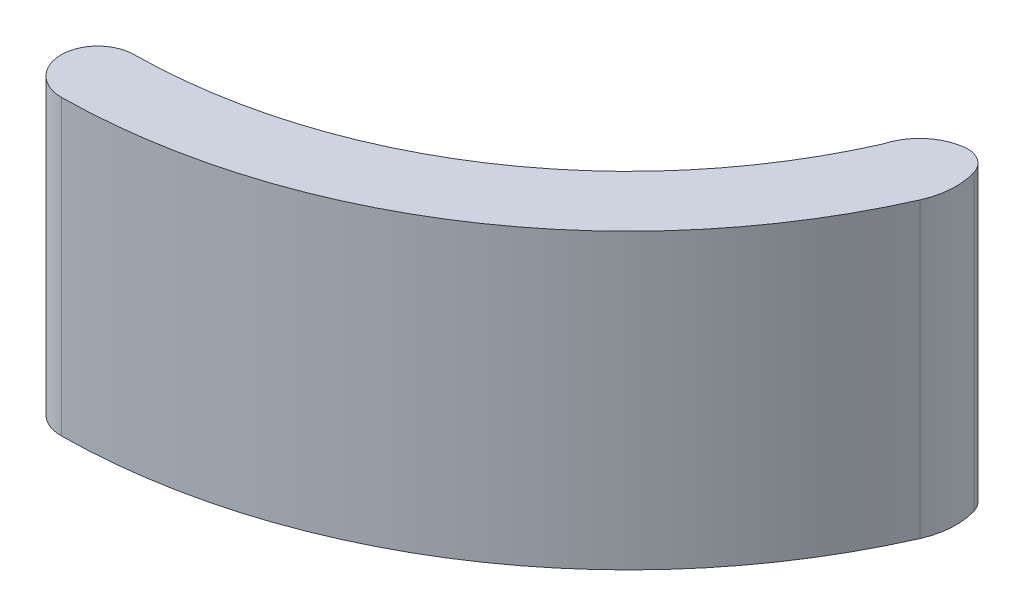
ISO-10303-21;
HEADER;
FILE_DESCRIPTION(('STEP AP214'),'2;1');
FILE_NAME('part.step','',(''),(''),'','','');
FILE_SCHEMA(('AUTOMOTIVE_DESIGN { 1 0 10303 214 1 1 1 1 }'));
ENDSEC;
DATA;
#1=APPLICATION_CONTEXT('core data for automotive mechanical design processes');
#2=APPLICATION_PROTOCOL_DEFINITION('international standard','automotive_design',2000,#1);
#3=PRODUCT_CONTEXT('',#1,'mechanical');
#4=PRODUCT('Part','Part','',(#3));
#5=PRODUCT_RELATED_PRODUCT_CATEGORY('part','',(#4));
#6=PRODUCT_DEFINITION_FORMATION('','',#4);
#7=PRODUCT_DEFINITION_CONTEXT('part definition',#1,'design');
#8=PRODUCT_DEFINITION('design','',#6,#7);
#9=PRODUCT_DEFINITION_SHAPE('','',#8);
#10=(LENGTH_UNIT() NAMED_UNIT(*) SI_UNIT(.MILLI.,.METRE.));
#11=(NAMED_UNIT(*) PLANE_ANGLE_UNIT() SI_UNIT($,.RADIAN.));
#12=(NAMED_UNIT(*) SI_UNIT($,.STERADIAN.) SOLID_ANGLE_UNIT());
#13=UNCERTAINTY_MEASURE_WITH_UNIT(LENGTH_MEASURE(1.E-05),#10,'distance_accuracy_value','');
#14=(GEOMETRIC_REPRESENTATION_CONTEXT(3) GLOBAL_UNCERTAINTY_ASSIGNED_CONTEXT((#13)) GLOBAL_UNIT_ASSIGNED_CONTEXT((#10,
#11,#12)) REPRESENTATION_CONTEXT('',''));
#15=CARTESIAN_POINT('',(0.,0.,0.));
#16=DIRECTION('',(0.,0.,1.));
#17=DIRECTION('',(1.,0.,0.));
#18=AXIS2_PLACEMENT_3D('',#15,#16,#17);
#19=CARTESIAN_POINT('',(21.1951243828312,24.,-30.1058136456201));
#20=DIRECTION('',(0.,-1.,0.));
#21=DIRECTION('',(0.,0.,-1.));
#22=AXIS2_PLACEMENT_3D('',#19,#20,#21);
#23=CYLINDRICAL_SURFACE('',#22,46.8251793751581);
#24=CARTESIAN_POINT('',(21.1951243828312,0.,-30.1058136456201));
#25=DIRECTION('',(0.,1.,0.));
#26=DIRECTION('',(0.,0.,1.));
#27=AXIS2_PLACEMENT_3D('',#24,#25,#26);
#28=CIRCLE('',#27,46.8251793751581);
#29=CARTESIAN_POINT('',(21.6130094490921,0.,16.7175010126474));
#30=VERTEX_POINT('',#29);
#31=CARTESIAN_POINT('',(64.0088987146232,0.,-11.1432676408737));
#32=VERTEX_POINT('',#31);
#33=EDGE_CURVE('E107',#30,#32,#28,.T.);
#34=ORIENTED_EDGE('',*,*,#33,.T.);
#35=DIRECTION('',(0.,-1.,0.));
#36=VECTOR('',#35,1.);
#37=CARTESIAN_POINT('',(64.0088987146232,24.,-11.1432676408737));
#38=LINE('',#37,#36);
#39=CARTESIAN_POINT('',(64.0088987146232,24.,-11.1432676408737));
#40=VERTEX_POINT('',#39);
#41=EDGE_CURVE('E90',#40,#32,#38,.T.);
#42=ORIENTED_EDGE('',*,*,#41,.F.);
#43=CARTESIAN_POINT('',(21.1951243828312,24.,-30.1058136456201));
#44=DIRECTION('',(0.,1.,0.));
#45=DIRECTION('',(0.,0.,1.));
#46=AXIS2_PLACEMENT_3D('',#43,#44,#45);
#47=CIRCLE('',#46,46.8251793751581);
#48=CARTESIAN_POINT('',(21.6130094490921,24.,16.7175010126474));
#49=VERTEX_POINT('',#48);
#50=EDGE_CURVE('E95',#49,#40,#47,.T.);
#51=ORIENTED_EDGE('',*,*,#50,.F.);
#52=DIRECTION('',(0.,-1.,0.));
#53=VECTOR('',#52,1.);
#54=CARTESIAN_POINT('',(21.6130094490921,24.,16.7175010126474));
#55=LINE('',#54,#53);
#56=EDGE_CURVE('E120',#49,#30,#55,.T.);
#57=ORIENTED_EDGE('',*,*,#56,.T.);
#58=EDGE_LOOP('',(#34,#42,#51,#57));
#59=FACE_BOUND('',#58,.T.);
#60=ADVANCED_FACE('F37',(#59),#23,.T.);
#61=CARTESIAN_POINT('',(58.5229048664708,24.,-13.5730560057388));
#62=DIRECTION('',(0.,-1.,0.));
#63=DIRECTION('',(0.,0.,-1.));
#64=AXIS2_PLACEMENT_3D('',#61,#62,#63);
#65=CYLINDRICAL_SURFACE('',#64,6.);
#66=CARTESIAN_POINT('',(58.5229048664708,0.,-13.5730560057388));
#67=DIRECTION('',(0.,1.,0.));
#68=DIRECTION('',(0.,0.,1.));
#69=AXIS2_PLACEMENT_3D('',#66,#67,#68);
#70=CIRCLE('',#69,6.);
#71=CARTESIAN_POINT('',(64.2787971457775,0.,-15.2670760968292));
#72=VERTEX_POINT('',#71);
#73=EDGE_CURVE('E127',#32,#72,#70,.T.);
#74=ORIENTED_EDGE('',*,*,#73,.T.);
#75=DIRECTION('',(0.,-1.,0.));
#76=VECTOR('',#75,1.);
#77=CARTESIAN_POINT('',(64.2787971457775,24.,-15.2670760968292));
#78=LINE('',#77,#76);
#79=CARTESIAN_POINT('',(64.2787971457775,24.,-15.2670760968292));
#80=VERTEX_POINT('',#79);
#81=EDGE_CURVE('E45',#72,#80,#78,.F.);
#82=ORIENTED_EDGE('',*,*,#81,.T.);
#83=CARTESIAN_POINT('',(58.5229048664708,24.,-13.5730560057388));
#84=DIRECTION('',(0.,1.,0.));
#85=DIRECTION('',(0.,0.,1.));
#86=AXIS2_PLACEMENT_3D('',#83,#84,#85);
#87=CIRCLE('',#86,6.);
#88=EDGE_CURVE('E86',#40,#80,#87,.T.);
#89=ORIENTED_EDGE('',*,*,#88,.F.);
#90=ORIENTED_EDGE('',*,*,#41,.T.);
#91=EDGE_LOOP('',(#74,#82,#89,#90));
#92=FACE_BOUND('',#91,.T.);
#93=ADVANCED_FACE('F88',(#92),#65,.T.);
#94=CARTESIAN_POINT('',(62.6209810778241,24.,-12.4749797943854));
#95=DIRECTION('',(0.,-1.,0.));
#96=DIRECTION('',(0.,0.,-1.));
#97=AXIS2_PLACEMENT_3D('',#94,#95,#96);
#98=CYLINDRICAL_SURFACE('',#97,4.24264068711929);
#99=CARTESIAN_POINT('',(62.6209810778241,24.,-12.4749797943854));
#100=DIRECTION('',(0.,1.,0.));
#101=DIRECTION('',(0.,0.,1.));
#102=AXIS2_PLACEMENT_3D('',#99,#100,#101);
#103=CIRCLE('',#102,4.24264068711929);
#104=CARTESIAN_POINT('',(62.1275703278763,24.,-16.6888314566816));
#105=VERTEX_POINT('',#104);
#106=CARTESIAN_POINT('',(58.5229048664708,24.,-13.5730560057387));
#107=VERTEX_POINT('',#106);
#108=EDGE_CURVE('E94',#105,#107,#103,.T.);
#109=ORIENTED_EDGE('',*,*,#108,.F.);
#110=DIRECTION('',(0.,-1.,0.));
#111=VECTOR('',#110,1.);
#112=CARTESIAN_POINT('',(62.1275703278763,24.,-16.6888314566816));
#113=LINE('',#112,#111);
#114=CARTESIAN_POINT('',(62.1275703278763,0.,-16.6888314566816));
#115=VERTEX_POINT('',#114);
#116=EDGE_CURVE('E108',#105,#115,#113,.T.);
#117=ORIENTED_EDGE('',*,*,#116,.T.);
#118=CARTESIAN_POINT('',(62.6209810778241,0.,-12.4749797943854));
#119=DIRECTION('',(0.,1.,0.));
#120=DIRECTION('',(0.,0.,1.));
#121=AXIS2_PLACEMENT_3D('',#118,#119,#120);
#122=CIRCLE('',#121,4.24264068711929);
#123=CARTESIAN_POINT('',(58.5229048664708,0.,-13.5730560057387));
#124=VERTEX_POINT('',#123);
#125=EDGE_CURVE('E125',#115,#124,#122,.T.);
#126=ORIENTED_EDGE('',*,*,#125,.T.);
#127=DIRECTION('',(0.,-1.,0.));
#128=VECTOR('',#127,1.);
#129=CARTESIAN_POINT('',(58.5229048664708,24.,-13.5730560057387));
#130=LINE('',#129,#128);
#131=EDGE_CURVE('E109',#107,#124,#130,.T.);
#132=ORIENTED_EDGE('',*,*,#131,.F.);
#133=EDGE_LOOP('',(#109,#117,#126,#132));
#134=FACE_BOUND('',#133,.T.);
#135=ADVANCED_FACE('F139',(#134),#98,.T.);
#136=CARTESIAN_POINT('',(21.1951243828312,24.,-30.1058136456201));
#137=DIRECTION('',(0.,-1.,0.));
#138=DIRECTION('',(0.,0.,-1.));
#139=AXIS2_PLACEMENT_3D('',#136,#137,#138);
#140=CYLINDRICAL_SURFACE('',#139,40.8251793751581);
#141=CARTESIAN_POINT('',(21.1951243828312,0.,-30.1058136456201));
#142=DIRECTION('',(0.,-1.,0.));
#143=DIRECTION('',(0.,0.,1.));
#144=AXIS2_PLACEMENT_3D('',#141,#142,#143);
#145=CIRCLE('',#144,40.8251793751581);
#146=CARTESIAN_POINT('',(21.5594632495682,0.,10.717739950362));
#147=VERTEX_POINT('',#146);
#148=EDGE_CURVE('E123',#124,#147,#145,.T.);
#149=ORIENTED_EDGE('',*,*,#148,.T.);
#150=DIRECTION('',(0.,-1.,0.));
#151=VECTOR('',#150,1.);
#152=CARTESIAN_POINT('',(21.5594632495682,24.,10.717739950362));
#153=LINE('',#152,#151);
#154=CARTESIAN_POINT('',(21.5594632495682,24.,10.717739950362));
#155=VERTEX_POINT('',#154);
#156=EDGE_CURVE('E114',#155,#147,#153,.T.);
#157=ORIENTED_EDGE('',*,*,#156,.F.);
#158=CARTESIAN_POINT('',(21.1951243828312,24.,-30.1058136456201));
#159=DIRECTION('',(0.,-1.,0.));
#160=DIRECTION('',(0.,0.,1.));
#161=AXIS2_PLACEMENT_3D('',#158,#159,#160);
#162=CIRCLE('',#161,40.8251793751581);
#163=EDGE_CURVE('E131',#107,#155,#162,.T.);
#164=ORIENTED_EDGE('',*,*,#163,.F.);
#165=ORIENTED_EDGE('',*,*,#131,.T.);
#166=EDGE_LOOP('',(#149,#157,#164,#165));
#167=FACE_BOUND('',#166,.T.);
#168=ADVANCED_FACE('F142',(#167),#140,.F.);
#169=CARTESIAN_POINT('',(21.5862363493302,24.,13.7176204815047));
#170=DIRECTION('',(0.,-1.,0.));
#171=DIRECTION('',(0.,0.,-1.));
#172=AXIS2_PLACEMENT_3D('',#169,#170,#171);
#173=CYLINDRICAL_SURFACE('',#172,3.);
#174=CARTESIAN_POINT('',(21.5862363493302,0.,13.7176204815047));
#175=DIRECTION('',(0.,1.,0.));
#176=DIRECTION('',(0.,0.,1.));
#177=AXIS2_PLACEMENT_3D('',#174,#175,#176);
#178=CIRCLE('',#177,3.);
#179=EDGE_CURVE('E104',#147,#30,#178,.T.);
#180=ORIENTED_EDGE('',*,*,#179,.T.);
#181=ORIENTED_EDGE('',*,*,#56,.F.);
#182=CARTESIAN_POINT('',(21.5862363493302,24.,13.7176204815047));
#183=DIRECTION('',(0.,1.,0.));
#184=DIRECTION('',(0.,0.,1.));
#185=AXIS2_PLACEMENT_3D('',#182,#183,#184);
#186=CIRCLE('',#185,3.);
#187=EDGE_CURVE('E100',#155,#49,#186,.T.);
#188=ORIENTED_EDGE('',*,*,#187,.F.);
#189=ORIENTED_EDGE('',*,*,#156,.T.);
#190=EDGE_LOOP('',(#180,#181,#188,#189));
#191=FACE_BOUND('',#190,.T.);
#192=ADVANCED_FACE('F145',(#191),#173,.T.);
#193=CARTESIAN_POINT('',(39.859014624651,24.,-21.8394348256794));
#194=DIRECTION('',(0.,1.,0.));
#195=DIRECTION('',(0.,0.,1.));
#196=AXIS2_PLACEMENT_3D('',#193,#194,#195);
#197=PLANE('',#196);
#198=ORIENTED_EDGE('',*,*,#88,.T.);
#199=CARTESIAN_POINT('',(62.3601663860086,24.,-14.7024027331324));
#200=DIRECTION('',(0.,1.,0.));
#201=DIRECTION('',(0.,0.,1.));
#202=AXIS2_PLACEMENT_3D('',#199,#200,#201);
#203=CIRCLE('',#202,2.);
#204=EDGE_CURVE('E11',#80,#105,#203,.T.);
#205=ORIENTED_EDGE('',*,*,#204,.T.);
#206=ORIENTED_EDGE('',*,*,#108,.T.);
#207=ORIENTED_EDGE('',*,*,#163,.T.);
#208=ORIENTED_EDGE('',*,*,#187,.T.);
#209=ORIENTED_EDGE('',*,*,#50,.T.);
#210=EDGE_LOOP('',(#198,#205,#206,#207,#208,#209));
#211=FACE_BOUND('',#210,.T.);
#212=ADVANCED_FACE('F98',(#211),#197,.T.);
#213=CARTESIAN_POINT('',(39.859014624651,0.,-21.8394348256794));
#214=DIRECTION('',(0.,1.,0.));
#215=DIRECTION('',(0.,0.,1.));
#216=AXIS2_PLACEMENT_3D('',#213,#214,#215);
#217=PLANE('',#216);
#218=ORIENTED_EDGE('',*,*,#125,.F.);
#219=CARTESIAN_POINT('',(62.3601663860086,0.,-14.7024027331324));
#220=DIRECTION('',(0.,1.,0.));
#221=DIRECTION('',(0.,0.,1.));
#222=AXIS2_PLACEMENT_3D('',#219,#220,#221);
#223=CIRCLE('',#222,2.);
#224=EDGE_CURVE('E59',#115,#72,#223,.F.);
#225=ORIENTED_EDGE('',*,*,#224,.T.);
#226=ORIENTED_EDGE('',*,*,#73,.F.);
#227=ORIENTED_EDGE('',*,*,#33,.F.);
#228=ORIENTED_EDGE('',*,*,#179,.F.);
#229=ORIENTED_EDGE('',*,*,#148,.F.);
#230=EDGE_LOOP('',(#218,#225,#226,#227,#228,#229));
#231=FACE_BOUND('',#230,.T.);
#232=ADVANCED_FACE('F146',(#231),#217,.F.);
#233=CARTESIAN_POINT('',(62.3601663860086,24.,-14.7024027331324));
#234=DIRECTION('',(0.,-1.,0.));
#235=DIRECTION('',(0.,0.,-1.));
#236=AXIS2_PLACEMENT_3D('',#233,#234,#235);
#237=CYLINDRICAL_SURFACE('',#236,2.);
#238=ORIENTED_EDGE('',*,*,#204,.F.);
#239=ORIENTED_EDGE('',*,*,#81,.F.);
#240=ORIENTED_EDGE('',*,*,#224,.F.);
#241=ORIENTED_EDGE('',*,*,#116,.F.);
#242=EDGE_LOOP('',(#238,#239,#240,#241));
#243=FACE_BOUND('',#242,.T.);
#244=ADVANCED_FACE('F39',(#243),#237,.T.);
#245=CLOSED_SHELL('',(#60,#93,#135,#168,#192,#212,#232,#244));
#246=MANIFOLD_SOLID_BREP('B2',#245);
#247=ADVANCED_BREP_SHAPE_REPRESENTATION('',(#18,#246),#14);
#248=SHAPE_DEFINITION_REPRESENTATION(#9,#247);
ENDSEC;
END-ISO-10303-21;
